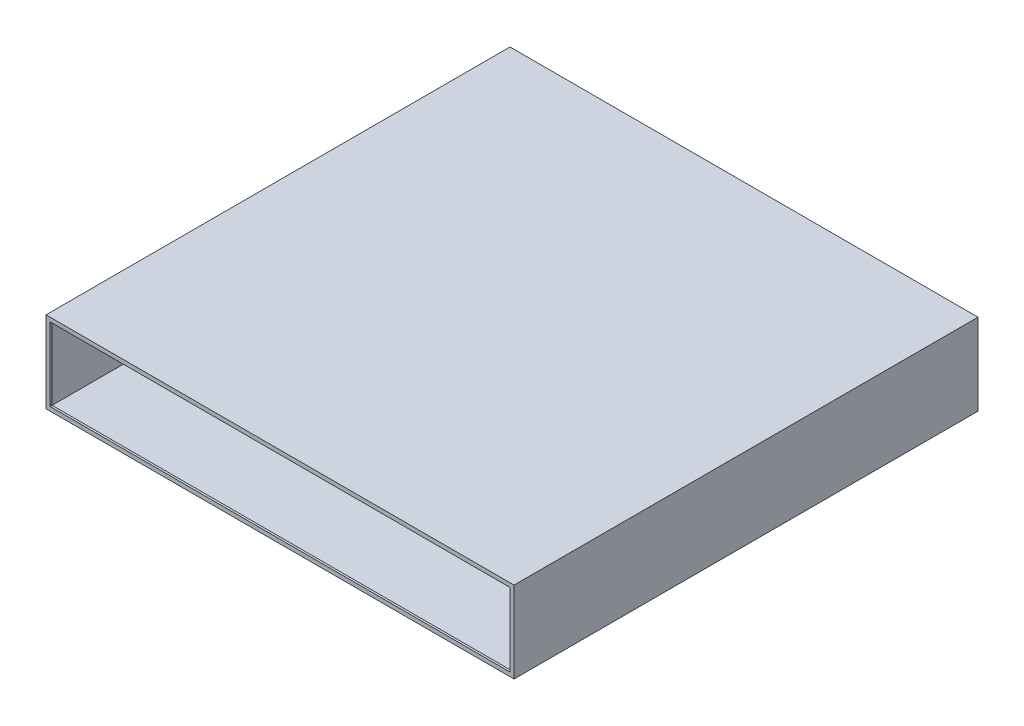
ISO-10303-21;
HEADER;
FILE_DESCRIPTION(('STEP AP214'),'2;1');
FILE_NAME('part.step','',(''),(''),'','','');
FILE_SCHEMA(('AUTOMOTIVE_DESIGN { 1 0 10303 214 1 1 1 1 }'));
ENDSEC;
DATA;
#1=APPLICATION_CONTEXT('core data for automotive mechanical design processes');
#2=APPLICATION_PROTOCOL_DEFINITION('international standard','automotive_design',2000,#1);
#3=PRODUCT_CONTEXT('',#1,'mechanical');
#4=PRODUCT('Part','Part','',(#3));
#5=PRODUCT_RELATED_PRODUCT_CATEGORY('part','',(#4));
#6=PRODUCT_DEFINITION_FORMATION('','',#4);
#7=PRODUCT_DEFINITION_CONTEXT('part definition',#1,'design');
#8=PRODUCT_DEFINITION('design','',#6,#7);
#9=PRODUCT_DEFINITION_SHAPE('','',#8);
#10=(LENGTH_UNIT() NAMED_UNIT(*) SI_UNIT(.MILLI.,.METRE.));
#11=(NAMED_UNIT(*) PLANE_ANGLE_UNIT() SI_UNIT($,.RADIAN.));
#12=(NAMED_UNIT(*) SI_UNIT($,.STERADIAN.) SOLID_ANGLE_UNIT());
#13=UNCERTAINTY_MEASURE_WITH_UNIT(LENGTH_MEASURE(1.E-05),#10,'distance_accuracy_value','');
#14=(GEOMETRIC_REPRESENTATION_CONTEXT(3) GLOBAL_UNCERTAINTY_ASSIGNED_CONTEXT((#13)) GLOBAL_UNIT_ASSIGNED_CONTEXT((#10,
#11,#12)) REPRESENTATION_CONTEXT('',''));
#15=CARTESIAN_POINT('',(0.,0.,0.));
#16=DIRECTION('',(0.,0.,1.));
#17=DIRECTION('',(1.,0.,0.));
#18=AXIS2_PLACEMENT_3D('',#15,#16,#17);
#19=CARTESIAN_POINT('',(228.6,38.1,457.2));
#20=DIRECTION('',(-1.,0.,0.));
#21=DIRECTION('',(0.,-1.,0.));
#22=AXIS2_PLACEMENT_3D('',#19,#20,#21);
#23=PLANE('',#22);
#24=DIRECTION('',(0.,0.,-1.));
#25=VECTOR('',#24,1.);
#26=CARTESIAN_POINT('',(228.6,-38.1,457.2));
#27=LINE('',#26,#25);
#28=CARTESIAN_POINT('',(228.6,-38.1,455.2));
#29=VERTEX_POINT('',#28);
#30=CARTESIAN_POINT('',(228.6,-38.1,0.));
#31=VERTEX_POINT('',#30);
#32=EDGE_CURVE('E80',#29,#31,#27,.T.);
#33=ORIENTED_EDGE('',*,*,#32,.F.);
#34=DIRECTION('',(0.,1.,0.));
#35=VECTOR('',#34,1.);
#36=CARTESIAN_POINT('',(228.6,38.1,455.2));
#37=LINE('',#36,#35);
#38=CARTESIAN_POINT('',(228.6,38.1,455.2));
#39=VERTEX_POINT('',#38);
#40=EDGE_CURVE('E74',#29,#39,#37,.T.);
#41=ORIENTED_EDGE('',*,*,#40,.T.);
#42=DIRECTION('',(0.,0.,-1.));
#43=VECTOR('',#42,1.);
#44=CARTESIAN_POINT('',(228.6,38.1,457.2));
#45=LINE('',#44,#43);
#46=CARTESIAN_POINT('',(228.6,38.1,0.));
#47=VERTEX_POINT('',#46);
#48=EDGE_CURVE('E214',#39,#47,#45,.T.);
#49=ORIENTED_EDGE('',*,*,#48,.T.);
#50=DIRECTION('',(0.,1.,0.));
#51=VECTOR('',#50,1.);
#52=CARTESIAN_POINT('',(228.6,38.1,0.));
#53=LINE('',#52,#51);
#54=EDGE_CURVE('E197',#31,#47,#53,.T.);
#55=ORIENTED_EDGE('',*,*,#54,.F.);
#56=EDGE_LOOP('',(#33,#41,#49,#55));
#57=FACE_BOUND('',#56,.T.);
#58=ADVANCED_FACE('F59',(#57),#23,.T.);
#59=CARTESIAN_POINT('',(-228.6,38.1,457.2));
#60=DIRECTION('',(0.,-1.,0.));
#61=DIRECTION('',(0.,0.,-1.));
#62=AXIS2_PLACEMENT_3D('',#59,#60,#61);
#63=PLANE('',#62);
#64=ORIENTED_EDGE('',*,*,#48,.F.);
#65=DIRECTION('',(-1.,0.,0.));
#66=VECTOR('',#65,1.);
#67=CARTESIAN_POINT('',(-228.6,38.1,455.2));
#68=LINE('',#67,#66);
#69=CARTESIAN_POINT('',(-228.6,38.1,455.2));
#70=VERTEX_POINT('',#69);
#71=EDGE_CURVE('E193',#39,#70,#68,.T.);
#72=ORIENTED_EDGE('',*,*,#71,.T.);
#73=DIRECTION('',(0.,0.,-1.));
#74=VECTOR('',#73,1.);
#75=CARTESIAN_POINT('',(-228.6,38.1,457.2));
#76=LINE('',#75,#74);
#77=CARTESIAN_POINT('',(-228.6,38.1,0.));
#78=VERTEX_POINT('',#77);
#79=EDGE_CURVE('E212',#70,#78,#76,.T.);
#80=ORIENTED_EDGE('',*,*,#79,.T.);
#81=DIRECTION('',(-1.,0.,0.));
#82=VECTOR('',#81,1.);
#83=CARTESIAN_POINT('',(-228.6,38.1,0.));
#84=LINE('',#83,#82);
#85=EDGE_CURVE('E200',#47,#78,#84,.T.);
#86=ORIENTED_EDGE('',*,*,#85,.F.);
#87=EDGE_LOOP('',(#64,#72,#80,#86));
#88=FACE_BOUND('',#87,.T.);
#89=ADVANCED_FACE('F284',(#88),#63,.T.);
#90=CARTESIAN_POINT('',(-228.6,38.1,457.2));
#91=DIRECTION('',(1.,0.,0.));
#92=DIRECTION('',(0.,1.,0.));
#93=AXIS2_PLACEMENT_3D('',#90,#91,#92);
#94=PLANE('',#93);
#95=ORIENTED_EDGE('',*,*,#79,.F.);
#96=DIRECTION('',(0.,-1.,0.));
#97=VECTOR('',#96,1.);
#98=CARTESIAN_POINT('',(-228.6,38.1,455.2));
#99=LINE('',#98,#97);
#100=CARTESIAN_POINT('',(-228.6,-38.1,455.2));
#101=VERTEX_POINT('',#100);
#102=EDGE_CURVE('E187',#70,#101,#99,.T.);
#103=ORIENTED_EDGE('',*,*,#102,.T.);
#104=DIRECTION('',(0.,0.,-1.));
#105=VECTOR('',#104,1.);
#106=CARTESIAN_POINT('',(-228.6,-38.1,457.2));
#107=LINE('',#106,#105);
#108=CARTESIAN_POINT('',(-228.6,-38.1,0.));
#109=VERTEX_POINT('',#108);
#110=EDGE_CURVE('E210',#101,#109,#107,.T.);
#111=ORIENTED_EDGE('',*,*,#110,.T.);
#112=DIRECTION('',(0.,-1.,0.));
#113=VECTOR('',#112,1.);
#114=CARTESIAN_POINT('',(-228.6,38.1,0.));
#115=LINE('',#114,#113);
#116=EDGE_CURVE('E203',#78,#109,#115,.T.);
#117=ORIENTED_EDGE('',*,*,#116,.F.);
#118=EDGE_LOOP('',(#95,#103,#111,#117));
#119=FACE_BOUND('',#118,.T.);
#120=ADVANCED_FACE('F290',(#119),#94,.T.);
#121=CARTESIAN_POINT('',(-228.6,-38.1,457.2));
#122=DIRECTION('',(0.,1.,0.));
#123=DIRECTION('',(0.,0.,1.));
#124=AXIS2_PLACEMENT_3D('',#121,#122,#123);
#125=PLANE('',#124);
#126=ORIENTED_EDGE('',*,*,#110,.F.);
#127=DIRECTION('',(1.,0.,0.));
#128=VECTOR('',#127,1.);
#129=CARTESIAN_POINT('',(-228.6,-38.1,455.2));
#130=LINE('',#129,#128);
#131=EDGE_CURVE('E12',#101,#29,#130,.T.);
#132=ORIENTED_EDGE('',*,*,#131,.T.);
#133=ORIENTED_EDGE('',*,*,#32,.T.);
#134=DIRECTION('',(1.,0.,0.));
#135=VECTOR('',#134,1.);
#136=CARTESIAN_POINT('',(-228.6,-38.1,0.));
#137=LINE('',#136,#135);
#138=EDGE_CURVE('E206',#109,#31,#137,.T.);
#139=ORIENTED_EDGE('',*,*,#138,.F.);
#140=EDGE_LOOP('',(#126,#132,#133,#139));
#141=FACE_BOUND('',#140,.T.);
#142=ADVANCED_FACE('F267',(#141),#125,.T.);
#143=CARTESIAN_POINT('',(0.,0.,457.2));
#144=DIRECTION('',(0.,0.,1.));
#145=DIRECTION('',(1.,0.,0.));
#146=AXIS2_PLACEMENT_3D('',#143,#144,#145);
#147=PLANE('',#146);
#148=DIRECTION('',(0.,1.,0.));
#149=VECTOR('',#148,1.);
#150=CARTESIAN_POINT('',(230.6,38.1,457.2));
#151=LINE('',#150,#149);
#152=CARTESIAN_POINT('',(230.6,-40.1,457.2));
#153=VERTEX_POINT('',#152);
#154=CARTESIAN_POINT('',(230.6,40.1,457.2));
#155=VERTEX_POINT('',#154);
#156=EDGE_CURVE('E217',#153,#155,#151,.T.);
#157=ORIENTED_EDGE('',*,*,#156,.T.);
#158=DIRECTION('',(-1.,0.,0.));
#159=VECTOR('',#158,1.);
#160=CARTESIAN_POINT('',(-228.6,40.1,457.2));
#161=LINE('',#160,#159);
#162=CARTESIAN_POINT('',(-230.6,40.1,457.2));
#163=VERTEX_POINT('',#162);
#164=EDGE_CURVE('E220',#155,#163,#161,.T.);
#165=ORIENTED_EDGE('',*,*,#164,.T.);
#166=DIRECTION('',(0.,-1.,0.));
#167=VECTOR('',#166,1.);
#168=CARTESIAN_POINT('',(-230.6,38.1,457.2));
#169=LINE('',#168,#167);
#170=CARTESIAN_POINT('',(-230.6,-40.1,457.2));
#171=VERTEX_POINT('',#170);
#172=EDGE_CURVE('E223',#163,#171,#169,.T.);
#173=ORIENTED_EDGE('',*,*,#172,.T.);
#174=DIRECTION('',(1.,0.,0.));
#175=VECTOR('',#174,1.);
#176=CARTESIAN_POINT('',(-228.6,-40.1,457.2));
#177=LINE('',#176,#175);
#178=EDGE_CURVE('E225',#171,#153,#177,.T.);
#179=ORIENTED_EDGE('',*,*,#178,.T.);
#180=EDGE_LOOP('',(#157,#165,#173,#179));
#181=FACE_BOUND('',#180,.T.);
#182=DIRECTION('',(-1.,0.,0.));
#183=VECTOR('',#182,1.);
#184=CARTESIAN_POINT('',(-226.6,36.1,457.2));
#185=LINE('',#184,#183);
#186=CARTESIAN_POINT('',(226.6,36.1,457.2));
#187=VERTEX_POINT('',#186);
#188=CARTESIAN_POINT('',(-226.6,36.1,457.2));
#189=VERTEX_POINT('',#188);
#190=EDGE_CURVE('E155',#187,#189,#185,.T.);
#191=ORIENTED_EDGE('',*,*,#190,.F.);
#192=DIRECTION('',(0.,1.,0.));
#193=VECTOR('',#192,1.);
#194=CARTESIAN_POINT('',(226.6,36.1,457.2));
#195=LINE('',#194,#193);
#196=CARTESIAN_POINT('',(226.6,-36.1,457.2));
#197=VERTEX_POINT('',#196);
#198=EDGE_CURVE('E172',#197,#187,#195,.T.);
#199=ORIENTED_EDGE('',*,*,#198,.F.);
#200=DIRECTION('',(1.,0.,0.));
#201=VECTOR('',#200,1.);
#202=CARTESIAN_POINT('',(-226.6,-36.1,457.2));
#203=LINE('',#202,#201);
#204=CARTESIAN_POINT('',(-226.6,-36.1,457.2));
#205=VERTEX_POINT('',#204);
#206=EDGE_CURVE('E175',#205,#197,#203,.T.);
#207=ORIENTED_EDGE('',*,*,#206,.F.);
#208=DIRECTION('',(0.,-1.,0.));
#209=VECTOR('',#208,1.);
#210=CARTESIAN_POINT('',(-226.6,36.1,457.2));
#211=LINE('',#210,#209);
#212=EDGE_CURVE('E181',#189,#205,#211,.T.);
#213=ORIENTED_EDGE('',*,*,#212,.F.);
#214=EDGE_LOOP('',(#191,#199,#207,#213));
#215=FACE_BOUND('',#214,.T.);
#216=ADVANCED_FACE('F264',(#181,#215),#147,.T.);
#217=CARTESIAN_POINT('',(0.,0.,0.));
#218=DIRECTION('',(0.,0.,1.));
#219=DIRECTION('',(1.,0.,0.));
#220=AXIS2_PLACEMENT_3D('',#217,#218,#219);
#221=PLANE('',#220);
#222=DIRECTION('',(0.,1.,0.));
#223=VECTOR('',#222,1.);
#224=CARTESIAN_POINT('',(230.6,38.1,0.));
#225=LINE('',#224,#223);
#226=CARTESIAN_POINT('',(230.6,-40.1,0.));
#227=VERTEX_POINT('',#226);
#228=CARTESIAN_POINT('',(230.6,40.1,0.));
#229=VERTEX_POINT('',#228);
#230=EDGE_CURVE('E216',#227,#229,#225,.T.);
#231=ORIENTED_EDGE('',*,*,#230,.F.);
#232=DIRECTION('',(1.,0.,0.));
#233=VECTOR('',#232,1.);
#234=CARTESIAN_POINT('',(-228.6,-40.1,0.));
#235=LINE('',#234,#233);
#236=CARTESIAN_POINT('',(-230.6,-40.1,0.));
#237=VERTEX_POINT('',#236);
#238=EDGE_CURVE('E221',#237,#227,#235,.T.);
#239=ORIENTED_EDGE('',*,*,#238,.F.);
#240=DIRECTION('',(0.,-1.,0.));
#241=VECTOR('',#240,1.);
#242=CARTESIAN_POINT('',(-230.6,38.1,0.));
#243=LINE('',#242,#241);
#244=CARTESIAN_POINT('',(-230.6,40.1,0.));
#245=VERTEX_POINT('',#244);
#246=EDGE_CURVE('E233',#245,#237,#243,.T.);
#247=ORIENTED_EDGE('',*,*,#246,.F.);
#248=DIRECTION('',(-1.,0.,0.));
#249=VECTOR('',#248,1.);
#250=CARTESIAN_POINT('',(-228.6,40.1,0.));
#251=LINE('',#250,#249);
#252=EDGE_CURVE('E230',#229,#245,#251,.T.);
#253=ORIENTED_EDGE('',*,*,#252,.F.);
#254=EDGE_LOOP('',(#231,#239,#247,#253));
#255=FACE_BOUND('',#254,.T.);
#256=ORIENTED_EDGE('',*,*,#54,.T.);
#257=ORIENTED_EDGE('',*,*,#85,.T.);
#258=ORIENTED_EDGE('',*,*,#116,.T.);
#259=ORIENTED_EDGE('',*,*,#138,.T.);
#260=EDGE_LOOP('',(#256,#257,#258,#259));
#261=FACE_BOUND('',#260,.T.);
#262=ADVANCED_FACE('F252',(#255,#261),#221,.F.);
#263=CARTESIAN_POINT('',(230.6,38.1,457.2));
#264=DIRECTION('',(-1.,0.,0.));
#265=DIRECTION('',(0.,-1.,0.));
#266=AXIS2_PLACEMENT_3D('',#263,#264,#265);
#267=PLANE('',#266);
#268=DIRECTION('',(0.,0.,-1.));
#269=VECTOR('',#268,1.);
#270=CARTESIAN_POINT('',(230.6,-40.1,457.2));
#271=LINE('',#270,#269);
#272=EDGE_CURVE('E227',#153,#227,#271,.T.);
#273=ORIENTED_EDGE('',*,*,#272,.T.);
#274=ORIENTED_EDGE('',*,*,#230,.T.);
#275=DIRECTION('',(0.,0.,-1.));
#276=VECTOR('',#275,1.);
#277=CARTESIAN_POINT('',(230.6,40.1,457.2));
#278=LINE('',#277,#276);
#279=EDGE_CURVE('E67',#155,#229,#278,.T.);
#280=ORIENTED_EDGE('',*,*,#279,.F.);
#281=ORIENTED_EDGE('',*,*,#156,.F.);
#282=EDGE_LOOP('',(#273,#274,#280,#281));
#283=FACE_BOUND('',#282,.T.);
#284=ADVANCED_FACE('F61',(#283),#267,.F.);
#285=CARTESIAN_POINT('',(-228.6,40.1,457.2));
#286=DIRECTION('',(0.,-1.,0.));
#287=DIRECTION('',(0.,0.,-1.));
#288=AXIS2_PLACEMENT_3D('',#285,#286,#287);
#289=PLANE('',#288);
#290=ORIENTED_EDGE('',*,*,#279,.T.);
#291=ORIENTED_EDGE('',*,*,#252,.T.);
#292=DIRECTION('',(0.,0.,-1.));
#293=VECTOR('',#292,1.);
#294=CARTESIAN_POINT('',(-230.6,40.1,457.2));
#295=LINE('',#294,#293);
#296=EDGE_CURVE('E241',#163,#245,#295,.T.);
#297=ORIENTED_EDGE('',*,*,#296,.F.);
#298=ORIENTED_EDGE('',*,*,#164,.F.);
#299=EDGE_LOOP('',(#290,#291,#297,#298));
#300=FACE_BOUND('',#299,.T.);
#301=ADVANCED_FACE('F245',(#300),#289,.F.);
#302=CARTESIAN_POINT('',(-230.6,38.1,457.2));
#303=DIRECTION('',(1.,0.,0.));
#304=DIRECTION('',(0.,1.,0.));
#305=AXIS2_PLACEMENT_3D('',#302,#303,#304);
#306=PLANE('',#305);
#307=ORIENTED_EDGE('',*,*,#296,.T.);
#308=ORIENTED_EDGE('',*,*,#246,.T.);
#309=DIRECTION('',(0.,0.,-1.));
#310=VECTOR('',#309,1.);
#311=CARTESIAN_POINT('',(-230.6,-40.1,457.2));
#312=LINE('',#311,#310);
#313=EDGE_CURVE('E239',#171,#237,#312,.T.);
#314=ORIENTED_EDGE('',*,*,#313,.F.);
#315=ORIENTED_EDGE('',*,*,#172,.F.);
#316=EDGE_LOOP('',(#307,#308,#314,#315));
#317=FACE_BOUND('',#316,.T.);
#318=ADVANCED_FACE('F262',(#317),#306,.F.);
#319=CARTESIAN_POINT('',(-228.6,-40.1,457.2));
#320=DIRECTION('',(0.,1.,0.));
#321=DIRECTION('',(0.,0.,1.));
#322=AXIS2_PLACEMENT_3D('',#319,#320,#321);
#323=PLANE('',#322);
#324=ORIENTED_EDGE('',*,*,#313,.T.);
#325=ORIENTED_EDGE('',*,*,#238,.T.);
#326=ORIENTED_EDGE('',*,*,#272,.F.);
#327=ORIENTED_EDGE('',*,*,#178,.F.);
#328=EDGE_LOOP('',(#324,#325,#326,#327));
#329=FACE_BOUND('',#328,.T.);
#330=ADVANCED_FACE('F258',(#329),#323,.F.);
#331=CARTESIAN_POINT('',(0.,0.,455.2));
#332=DIRECTION('',(0.,0.,1.));
#333=DIRECTION('',(1.,0.,0.));
#334=AXIS2_PLACEMENT_3D('',#331,#332,#333);
#335=PLANE('',#334);
#336=ORIENTED_EDGE('',*,*,#40,.F.);
#337=ORIENTED_EDGE('',*,*,#131,.F.);
#338=ORIENTED_EDGE('',*,*,#102,.F.);
#339=ORIENTED_EDGE('',*,*,#71,.F.);
#340=EDGE_LOOP('',(#336,#337,#338,#339));
#341=FACE_BOUND('',#340,.T.);
#342=DIRECTION('',(0.,1.,0.));
#343=VECTOR('',#342,1.);
#344=CARTESIAN_POINT('',(226.6,36.1,455.2));
#345=LINE('',#344,#343);
#346=CARTESIAN_POINT('',(226.6,-36.1,455.2));
#347=VERTEX_POINT('',#346);
#348=CARTESIAN_POINT('',(226.6,36.1,455.2));
#349=VERTEX_POINT('',#348);
#350=EDGE_CURVE('E160',#347,#349,#345,.T.);
#351=ORIENTED_EDGE('',*,*,#350,.T.);
#352=DIRECTION('',(-1.,0.,0.));
#353=VECTOR('',#352,1.);
#354=CARTESIAN_POINT('',(-226.6,36.1,455.2));
#355=LINE('',#354,#353);
#356=CARTESIAN_POINT('',(-226.6,36.1,455.2));
#357=VERTEX_POINT('',#356);
#358=EDGE_CURVE('E152',#349,#357,#355,.T.);
#359=ORIENTED_EDGE('',*,*,#358,.T.);
#360=DIRECTION('',(0.,-1.,0.));
#361=VECTOR('',#360,1.);
#362=CARTESIAN_POINT('',(-226.6,36.1,455.2));
#363=LINE('',#362,#361);
#364=CARTESIAN_POINT('',(-226.6,-36.1,455.2));
#365=VERTEX_POINT('',#364);
#366=EDGE_CURVE('E164',#357,#365,#363,.T.);
#367=ORIENTED_EDGE('',*,*,#366,.T.);
#368=DIRECTION('',(1.,0.,0.));
#369=VECTOR('',#368,1.);
#370=CARTESIAN_POINT('',(-226.6,-36.1,455.2));
#371=LINE('',#370,#369);
#372=EDGE_CURVE('E168',#365,#347,#371,.T.);
#373=ORIENTED_EDGE('',*,*,#372,.T.);
#374=EDGE_LOOP('',(#351,#359,#367,#373));
#375=FACE_BOUND('',#374,.T.);
#376=ADVANCED_FACE('F170',(#341,#375),#335,.F.);
#377=CARTESIAN_POINT('',(-226.6,36.1,455.2));
#378=DIRECTION('',(0.,1.,0.));
#379=DIRECTION('',(0.,0.,1.));
#380=AXIS2_PLACEMENT_3D('',#377,#378,#379);
#381=PLANE('',#380);
#382=ORIENTED_EDGE('',*,*,#190,.T.);
#383=DIRECTION('',(0.,0.,1.));
#384=VECTOR('',#383,1.);
#385=CARTESIAN_POINT('',(-226.6,36.1,455.2));
#386=LINE('',#385,#384);
#387=EDGE_CURVE('E148',#357,#189,#386,.T.);
#388=ORIENTED_EDGE('',*,*,#387,.F.);
#389=ORIENTED_EDGE('',*,*,#358,.F.);
#390=DIRECTION('',(0.,0.,1.));
#391=VECTOR('',#390,1.);
#392=CARTESIAN_POINT('',(226.6,36.1,455.2));
#393=LINE('',#392,#391);
#394=EDGE_CURVE('E185',#349,#187,#393,.T.);
#395=ORIENTED_EDGE('',*,*,#394,.T.);
#396=EDGE_LOOP('',(#382,#388,#389,#395));
#397=FACE_BOUND('',#396,.T.);
#398=ADVANCED_FACE('F150',(#397),#381,.F.);
#399=CARTESIAN_POINT('',(226.6,36.1,455.2));
#400=DIRECTION('',(1.,0.,0.));
#401=DIRECTION('',(0.,1.,0.));
#402=AXIS2_PLACEMENT_3D('',#399,#400,#401);
#403=PLANE('',#402);
#404=ORIENTED_EDGE('',*,*,#198,.T.);
#405=ORIENTED_EDGE('',*,*,#394,.F.);
#406=ORIENTED_EDGE('',*,*,#350,.F.);
#407=DIRECTION('',(0.,0.,1.));
#408=VECTOR('',#407,1.);
#409=CARTESIAN_POINT('',(226.6,-36.1,455.2));
#410=LINE('',#409,#408);
#411=EDGE_CURVE('E188',#347,#197,#410,.T.);
#412=ORIENTED_EDGE('',*,*,#411,.T.);
#413=EDGE_LOOP('',(#404,#405,#406,#412));
#414=FACE_BOUND('',#413,.T.);
#415=ADVANCED_FACE('F274',(#414),#403,.F.);
#416=CARTESIAN_POINT('',(-226.6,-36.1,455.2));
#417=DIRECTION('',(0.,-1.,0.));
#418=DIRECTION('',(0.,0.,-1.));
#419=AXIS2_PLACEMENT_3D('',#416,#417,#418);
#420=PLANE('',#419);
#421=ORIENTED_EDGE('',*,*,#206,.T.);
#422=ORIENTED_EDGE('',*,*,#411,.F.);
#423=ORIENTED_EDGE('',*,*,#372,.F.);
#424=DIRECTION('',(0.,0.,1.));
#425=VECTOR('',#424,1.);
#426=CARTESIAN_POINT('',(-226.6,-36.1,455.2));
#427=LINE('',#426,#425);
#428=EDGE_CURVE('E159',#365,#205,#427,.T.);
#429=ORIENTED_EDGE('',*,*,#428,.T.);
#430=EDGE_LOOP('',(#421,#422,#423,#429));
#431=FACE_BOUND('',#430,.T.);
#432=ADVANCED_FACE('F272',(#431),#420,.F.);
#433=CARTESIAN_POINT('',(-226.6,36.1,455.2));
#434=DIRECTION('',(-1.,0.,0.));
#435=DIRECTION('',(0.,0.,1.));
#436=AXIS2_PLACEMENT_3D('',#433,#434,#435);
#437=PLANE('',#436);
#438=ORIENTED_EDGE('',*,*,#212,.T.);
#439=ORIENTED_EDGE('',*,*,#428,.F.);
#440=ORIENTED_EDGE('',*,*,#366,.F.);
#441=ORIENTED_EDGE('',*,*,#387,.T.);
#442=EDGE_LOOP('',(#438,#439,#440,#441));
#443=FACE_BOUND('',#442,.T.);
#444=ADVANCED_FACE('F165',(#443),#437,.F.);
#445=CLOSED_SHELL('',(#58,#89,#120,#142,#216,#262,#284,#301,#318,#330,#376,#398,#415,#432,#444));
#446=MANIFOLD_SOLID_BREP('B2',#445);
#447=ADVANCED_BREP_SHAPE_REPRESENTATION('',(#18,#446),#14);
#448=SHAPE_DEFINITION_REPRESENTATION(#9,#447);
ENDSEC;
END-ISO-10303-21;
